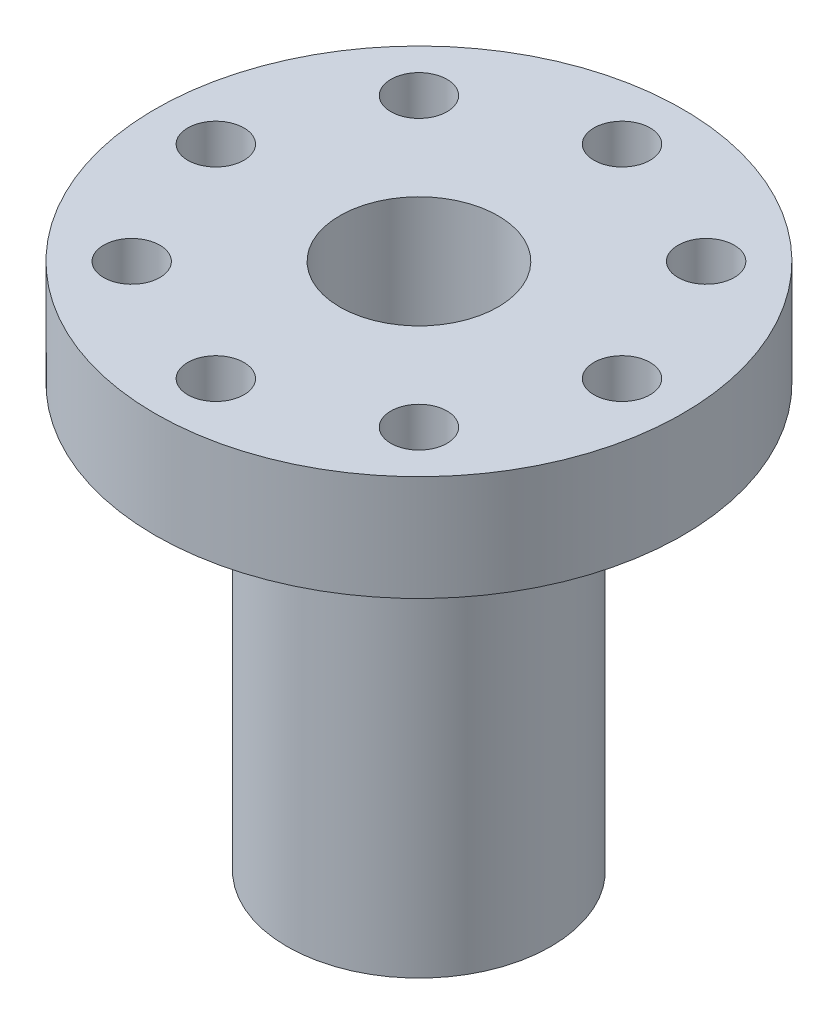
ISO-10303-21;
HEADER;
FILE_DESCRIPTION(('STEP AP214'),'2;1');
FILE_NAME('part.step','',(''),(''),'','','');
FILE_SCHEMA(('AUTOMOTIVE_DESIGN { 1 0 10303 214 1 1 1 1 }'));
ENDSEC;
DATA;
#1=APPLICATION_CONTEXT('core data for automotive mechanical design processes');
#2=APPLICATION_PROTOCOL_DEFINITION('international standard','automotive_design',2000,#1);
#3=PRODUCT_CONTEXT('',#1,'mechanical');
#4=PRODUCT('Part','Part','',(#3));
#5=PRODUCT_RELATED_PRODUCT_CATEGORY('part','',(#4));
#6=PRODUCT_DEFINITION_FORMATION('','',#4);
#7=PRODUCT_DEFINITION_CONTEXT('part definition',#1,'design');
#8=PRODUCT_DEFINITION('design','',#6,#7);
#9=PRODUCT_DEFINITION_SHAPE('','',#8);
#10=(LENGTH_UNIT() NAMED_UNIT(*) SI_UNIT(.MILLI.,.METRE.));
#11=(NAMED_UNIT(*) PLANE_ANGLE_UNIT() SI_UNIT($,.RADIAN.));
#12=(NAMED_UNIT(*) SI_UNIT($,.STERADIAN.) SOLID_ANGLE_UNIT());
#13=UNCERTAINTY_MEASURE_WITH_UNIT(LENGTH_MEASURE(1.E-05),#10,'distance_accuracy_value','');
#14=(GEOMETRIC_REPRESENTATION_CONTEXT(3) GLOBAL_UNCERTAINTY_ASSIGNED_CONTEXT((#13)) GLOBAL_UNIT_ASSIGNED_CONTEXT((#10,
#11,#12)) REPRESENTATION_CONTEXT('',''));
#15=CARTESIAN_POINT('',(0.,0.,0.));
#16=DIRECTION('',(0.,0.,1.));
#17=DIRECTION('',(1.,0.,0.));
#18=AXIS2_PLACEMENT_3D('',#15,#16,#17);
#19=CARTESIAN_POINT('',(0.,0.,0.));
#20=DIRECTION('',(0.,1.,0.));
#21=DIRECTION('',(0.,0.,1.));
#22=AXIS2_PLACEMENT_3D('',#19,#20,#21);
#23=CYLINDRICAL_SURFACE('',#22,12.7);
#24=CARTESIAN_POINT('',(0.,0.,0.));
#25=DIRECTION('',(0.,1.,0.));
#26=DIRECTION('',(0.,0.,1.));
#27=AXIS2_PLACEMENT_3D('',#24,#25,#26);
#28=CIRCLE('',#27,12.7);
#29=CARTESIAN_POINT('',(0.,0.,12.7));
#30=VERTEX_POINT('',#29);
#31=EDGE_CURVE('E10',#30,#30,#28,.T.);
#32=ORIENTED_EDGE('',*,*,#31,.F.);
#33=EDGE_LOOP('',(#32));
#34=FACE_BOUND('',#33,.T.);
#35=CARTESIAN_POINT('',(0.,-5.08,0.));
#36=DIRECTION('',(0.,1.,0.));
#37=DIRECTION('',(0.,0.,1.));
#38=AXIS2_PLACEMENT_3D('',#35,#36,#37);
#39=CIRCLE('',#38,12.7);
#40=CARTESIAN_POINT('',(0.,-5.08,12.7));
#41=VERTEX_POINT('',#40);
#42=EDGE_CURVE('E46',#41,#41,#39,.T.);
#43=ORIENTED_EDGE('',*,*,#42,.T.);
#44=EDGE_LOOP('',(#43));
#45=FACE_BOUND('',#44,.T.);
#46=ADVANCED_FACE('F32',(#34,#45),#23,.T.);
#47=CARTESIAN_POINT('',(12.7,0.,0.));
#48=DIRECTION('',(0.,-1.,0.));
#49=DIRECTION('',(0.,0.,-1.));
#50=AXIS2_PLACEMENT_3D('',#47,#48,#49);
#51=PLANE('',#50);
#52=CARTESIAN_POINT('',(0.,0.,0.));
#53=DIRECTION('',(0.,1.,0.));
#54=DIRECTION('',(0.,0.,1.));
#55=AXIS2_PLACEMENT_3D('',#52,#53,#54);
#56=CIRCLE('',#55,3.81);
#57=CARTESIAN_POINT('',(0.,0.,3.81));
#58=VERTEX_POINT('',#57);
#59=EDGE_CURVE('E100',#58,#58,#56,.T.);
#60=ORIENTED_EDGE('',*,*,#59,.F.);
#61=EDGE_LOOP('',(#60));
#62=FACE_BOUND('',#61,.T.);
#63=CARTESIAN_POINT('',(-6.91479721322316,0.,6.91479721322333));
#64=DIRECTION('',(0.,1.,0.));
#65=DIRECTION('',(0.,0.,1.));
#66=AXIS2_PLACEMENT_3D('',#63,#64,#65);
#67=CIRCLE('',#66,1.35255);
#68=CARTESIAN_POINT('',(-6.91479721322316,0.,8.26734721322333));
#69=VERTEX_POINT('',#68);
#70=EDGE_CURVE('E96',#69,#69,#67,.T.);
#71=ORIENTED_EDGE('',*,*,#70,.F.);
#72=EDGE_LOOP('',(#71));
#73=FACE_BOUND('',#72,.T.);
#74=CARTESIAN_POINT('',(-9.779,0.,1.02429588037641E-13));
#75=DIRECTION('',(0.,1.,0.));
#76=DIRECTION('',(0.,0.,1.));
#77=AXIS2_PLACEMENT_3D('',#74,#75,#76);
#78=CIRCLE('',#77,1.35255);
#79=CARTESIAN_POINT('',(-9.779,0.,1.3525500000001));
#80=VERTEX_POINT('',#79);
#81=EDGE_CURVE('E90',#80,#80,#78,.T.);
#82=ORIENTED_EDGE('',*,*,#81,.F.);
#83=EDGE_LOOP('',(#82));
#84=FACE_BOUND('',#83,.T.);
#85=CARTESIAN_POINT('',(-6.91479721322331,0.,-6.91479721322319));
#86=DIRECTION('',(0.,1.,0.));
#87=DIRECTION('',(0.,0.,1.));
#88=AXIS2_PLACEMENT_3D('',#85,#86,#87);
#89=CIRCLE('',#88,1.35255);
#90=CARTESIAN_POINT('',(-6.91479721322331,0.,-5.56224721322319));
#91=VERTEX_POINT('',#90);
#92=EDGE_CURVE('E84',#91,#91,#89,.T.);
#93=ORIENTED_EDGE('',*,*,#92,.F.);
#94=EDGE_LOOP('',(#93));
#95=FACE_BOUND('',#94,.T.);
#96=CARTESIAN_POINT('',(0.,0.,-9.779));
#97=DIRECTION('',(0.,1.,0.));
#98=DIRECTION('',(0.,0.,1.));
#99=AXIS2_PLACEMENT_3D('',#96,#97,#98);
#100=CIRCLE('',#99,1.35255);
#101=CARTESIAN_POINT('',(0.,0.,-8.42645));
#102=VERTEX_POINT('',#101);
#103=EDGE_CURVE('E78',#102,#102,#100,.T.);
#104=ORIENTED_EDGE('',*,*,#103,.F.);
#105=EDGE_LOOP('',(#104));
#106=FACE_BOUND('',#105,.T.);
#107=CARTESIAN_POINT('',(6.91479721322321,0.,-6.91479721322328));
#108=DIRECTION('',(0.,1.,0.));
#109=DIRECTION('',(0.,0.,1.));
#110=AXIS2_PLACEMENT_3D('',#107,#108,#109);
#111=CIRCLE('',#110,1.35255);
#112=CARTESIAN_POINT('',(6.91479721322321,0.,-5.56224721322329));
#113=VERTEX_POINT('',#112);
#114=EDGE_CURVE('E72',#113,#113,#111,.T.);
#115=ORIENTED_EDGE('',*,*,#114,.F.);
#116=EDGE_LOOP('',(#115));
#117=FACE_BOUND('',#116,.T.);
#118=CARTESIAN_POINT('',(9.779,0.,0.));
#119=DIRECTION('',(0.,1.,0.));
#120=DIRECTION('',(0.,0.,1.));
#121=AXIS2_PLACEMENT_3D('',#118,#119,#120);
#122=CIRCLE('',#121,1.35255);
#123=CARTESIAN_POINT('',(9.779,0.,1.35254999999996));
#124=VERTEX_POINT('',#123);
#125=EDGE_CURVE('E66',#124,#124,#122,.T.);
#126=ORIENTED_EDGE('',*,*,#125,.F.);
#127=EDGE_LOOP('',(#126));
#128=FACE_BOUND('',#127,.T.);
#129=CARTESIAN_POINT('',(6.91479721322326,0.,6.91479721322324));
#130=DIRECTION('',(0.,1.,0.));
#131=DIRECTION('',(0.,0.,1.));
#132=AXIS2_PLACEMENT_3D('',#129,#130,#131);
#133=CIRCLE('',#132,1.35255);
#134=CARTESIAN_POINT('',(6.91479721322326,0.,8.26734721322324));
#135=VERTEX_POINT('',#134);
#136=EDGE_CURVE('E60',#135,#135,#133,.T.);
#137=ORIENTED_EDGE('',*,*,#136,.F.);
#138=EDGE_LOOP('',(#137));
#139=FACE_BOUND('',#138,.T.);
#140=CARTESIAN_POINT('',(0.,0.,9.779));
#141=DIRECTION('',(0.,1.,0.));
#142=DIRECTION('',(0.,0.,1.));
#143=AXIS2_PLACEMENT_3D('',#140,#141,#142);
#144=CIRCLE('',#143,1.35255);
#145=CARTESIAN_POINT('',(0.,0.,11.13155));
#146=VERTEX_POINT('',#145);
#147=EDGE_CURVE('E54',#146,#146,#144,.T.);
#148=ORIENTED_EDGE('',*,*,#147,.F.);
#149=EDGE_LOOP('',(#148));
#150=FACE_BOUND('',#149,.T.);
#151=ORIENTED_EDGE('',*,*,#31,.T.);
#152=EDGE_LOOP('',(#151));
#153=FACE_BOUND('',#152,.T.);
#154=ADVANCED_FACE('F134',(#62,#73,#84,#95,#106,#117,#128,#139,#150,#153),#51,.F.);
#155=CARTESIAN_POINT('',(0.,-25.4,0.));
#156=DIRECTION('',(0.,1.,0.));
#157=DIRECTION('',(0.,0.,1.));
#158=AXIS2_PLACEMENT_3D('',#155,#156,#157);
#159=PLANE('',#158);
#160=CARTESIAN_POINT('',(0.,-25.4,0.));
#161=DIRECTION('',(0.,1.,0.));
#162=DIRECTION('',(0.,0.,1.));
#163=AXIS2_PLACEMENT_3D('',#160,#161,#162);
#164=CIRCLE('',#163,1.4986);
#165=CARTESIAN_POINT('',(0.,-25.4,1.4986));
#166=VERTEX_POINT('',#165);
#167=EDGE_CURVE('E103',#166,#166,#164,.T.);
#168=ORIENTED_EDGE('',*,*,#167,.T.);
#169=EDGE_LOOP('',(#168));
#170=FACE_BOUND('',#169,.T.);
#171=CARTESIAN_POINT('',(0.,-25.4,0.));
#172=DIRECTION('',(0.,1.,0.));
#173=DIRECTION('',(0.,0.,1.));
#174=AXIS2_PLACEMENT_3D('',#171,#172,#173);
#175=CIRCLE('',#174,6.35);
#176=CARTESIAN_POINT('',(0.,-25.4,6.35));
#177=VERTEX_POINT('',#176);
#178=EDGE_CURVE('E38',#177,#177,#175,.T.);
#179=ORIENTED_EDGE('',*,*,#178,.F.);
#180=EDGE_LOOP('',(#179));
#181=FACE_BOUND('',#180,.T.);
#182=ADVANCED_FACE('F112',(#170,#181),#159,.F.);
#183=CARTESIAN_POINT('',(0.,0.,0.));
#184=DIRECTION('',(0.,1.,0.));
#185=DIRECTION('',(0.,0.,1.));
#186=AXIS2_PLACEMENT_3D('',#183,#184,#185);
#187=CYLINDRICAL_SURFACE('',#186,6.35);
#188=CARTESIAN_POINT('',(0.,-5.08,0.));
#189=DIRECTION('',(0.,1.,0.));
#190=DIRECTION('',(0.,0.,1.));
#191=AXIS2_PLACEMENT_3D('',#188,#189,#190);
#192=CIRCLE('',#191,6.35);
#193=CARTESIAN_POINT('',(0.,-5.08,6.35));
#194=VERTEX_POINT('',#193);
#195=EDGE_CURVE('E42',#194,#194,#192,.T.);
#196=ORIENTED_EDGE('',*,*,#195,.F.);
#197=EDGE_LOOP('',(#196));
#198=FACE_BOUND('',#197,.T.);
#199=ORIENTED_EDGE('',*,*,#178,.T.);
#200=EDGE_LOOP('',(#199));
#201=FACE_BOUND('',#200,.T.);
#202=ADVANCED_FACE('F163',(#198,#201),#187,.T.);
#203=CARTESIAN_POINT('',(6.35,-5.08,0.));
#204=DIRECTION('',(0.,1.,0.));
#205=DIRECTION('',(0.,0.,1.));
#206=AXIS2_PLACEMENT_3D('',#203,#204,#205);
#207=PLANE('',#206);
#208=CARTESIAN_POINT('',(-6.91479721322316,-5.08,6.91479721322333));
#209=DIRECTION('',(0.,1.,0.));
#210=DIRECTION('',(0.,0.,1.));
#211=AXIS2_PLACEMENT_3D('',#208,#209,#210);
#212=CIRCLE('',#211,1.35255);
#213=CARTESIAN_POINT('',(-6.91479721322316,-5.08,8.26734721322333));
#214=VERTEX_POINT('',#213);
#215=EDGE_CURVE('E93',#214,#214,#212,.T.);
#216=ORIENTED_EDGE('',*,*,#215,.T.);
#217=EDGE_LOOP('',(#216));
#218=FACE_BOUND('',#217,.T.);
#219=CARTESIAN_POINT('',(-9.779,-5.08,1.02429588037641E-13));
#220=DIRECTION('',(0.,1.,0.));
#221=DIRECTION('',(0.,0.,1.));
#222=AXIS2_PLACEMENT_3D('',#219,#220,#221);
#223=CIRCLE('',#222,1.35255);
#224=CARTESIAN_POINT('',(-9.779,-5.08,1.3525500000001));
#225=VERTEX_POINT('',#224);
#226=EDGE_CURVE('E87',#225,#225,#223,.T.);
#227=ORIENTED_EDGE('',*,*,#226,.T.);
#228=EDGE_LOOP('',(#227));
#229=FACE_BOUND('',#228,.T.);
#230=CARTESIAN_POINT('',(-6.91479721322331,-5.08,-6.91479721322319));
#231=DIRECTION('',(0.,1.,0.));
#232=DIRECTION('',(0.,0.,1.));
#233=AXIS2_PLACEMENT_3D('',#230,#231,#232);
#234=CIRCLE('',#233,1.35255);
#235=CARTESIAN_POINT('',(-6.91479721322331,-5.08,-5.56224721322319));
#236=VERTEX_POINT('',#235);
#237=EDGE_CURVE('E81',#236,#236,#234,.T.);
#238=ORIENTED_EDGE('',*,*,#237,.T.);
#239=EDGE_LOOP('',(#238));
#240=FACE_BOUND('',#239,.T.);
#241=CARTESIAN_POINT('',(0.,-5.08,-9.779));
#242=DIRECTION('',(0.,1.,0.));
#243=DIRECTION('',(0.,0.,1.));
#244=AXIS2_PLACEMENT_3D('',#241,#242,#243);
#245=CIRCLE('',#244,1.35255);
#246=CARTESIAN_POINT('',(0.,-5.08,-8.42645));
#247=VERTEX_POINT('',#246);
#248=EDGE_CURVE('E75',#247,#247,#245,.T.);
#249=ORIENTED_EDGE('',*,*,#248,.T.);
#250=EDGE_LOOP('',(#249));
#251=FACE_BOUND('',#250,.T.);
#252=CARTESIAN_POINT('',(6.91479721322321,-5.08,-6.91479721322328));
#253=DIRECTION('',(0.,1.,0.));
#254=DIRECTION('',(0.,0.,1.));
#255=AXIS2_PLACEMENT_3D('',#252,#253,#254);
#256=CIRCLE('',#255,1.35255);
#257=CARTESIAN_POINT('',(6.91479721322321,-5.08,-5.56224721322329));
#258=VERTEX_POINT('',#257);
#259=EDGE_CURVE('E69',#258,#258,#256,.T.);
#260=ORIENTED_EDGE('',*,*,#259,.T.);
#261=EDGE_LOOP('',(#260));
#262=FACE_BOUND('',#261,.T.);
#263=CARTESIAN_POINT('',(9.779,-5.08,0.));
#264=DIRECTION('',(0.,1.,0.));
#265=DIRECTION('',(0.,0.,1.));
#266=AXIS2_PLACEMENT_3D('',#263,#264,#265);
#267=CIRCLE('',#266,1.35255);
#268=CARTESIAN_POINT('',(9.779,-5.08,1.35254999999996));
#269=VERTEX_POINT('',#268);
#270=EDGE_CURVE('E63',#269,#269,#267,.T.);
#271=ORIENTED_EDGE('',*,*,#270,.T.);
#272=EDGE_LOOP('',(#271));
#273=FACE_BOUND('',#272,.T.);
#274=CARTESIAN_POINT('',(6.91479721322326,-5.08,6.91479721322324));
#275=DIRECTION('',(0.,1.,0.));
#276=DIRECTION('',(0.,0.,1.));
#277=AXIS2_PLACEMENT_3D('',#274,#275,#276);
#278=CIRCLE('',#277,1.35255);
#279=CARTESIAN_POINT('',(6.91479721322326,-5.08,8.26734721322324));
#280=VERTEX_POINT('',#279);
#281=EDGE_CURVE('E57',#280,#280,#278,.T.);
#282=ORIENTED_EDGE('',*,*,#281,.T.);
#283=EDGE_LOOP('',(#282));
#284=FACE_BOUND('',#283,.T.);
#285=CARTESIAN_POINT('',(0.,-5.08,9.779));
#286=DIRECTION('',(0.,1.,0.));
#287=DIRECTION('',(0.,0.,1.));
#288=AXIS2_PLACEMENT_3D('',#285,#286,#287);
#289=CIRCLE('',#288,1.35255);
#290=CARTESIAN_POINT('',(0.,-5.08,11.13155));
#291=VERTEX_POINT('',#290);
#292=EDGE_CURVE('E51',#291,#291,#289,.T.);
#293=ORIENTED_EDGE('',*,*,#292,.T.);
#294=EDGE_LOOP('',(#293));
#295=FACE_BOUND('',#294,.T.);
#296=ORIENTED_EDGE('',*,*,#42,.F.);
#297=EDGE_LOOP('',(#296));
#298=FACE_BOUND('',#297,.T.);
#299=ORIENTED_EDGE('',*,*,#195,.T.);
#300=EDGE_LOOP('',(#299));
#301=FACE_BOUND('',#300,.T.);
#302=ADVANCED_FACE('F157',(#218,#229,#240,#251,#262,#273,#284,#295,#298,#301),#207,.F.);
#303=CARTESIAN_POINT('',(0.,0.,9.779));
#304=DIRECTION('',(0.,1.,0.));
#305=DIRECTION('',(0.,0.,1.));
#306=AXIS2_PLACEMENT_3D('',#303,#304,#305);
#307=CYLINDRICAL_SURFACE('',#306,1.35255);
#308=ORIENTED_EDGE('',*,*,#147,.T.);
#309=EDGE_LOOP('',(#308));
#310=FACE_BOUND('',#309,.T.);
#311=ORIENTED_EDGE('',*,*,#292,.F.);
#312=EDGE_LOOP('',(#311));
#313=FACE_BOUND('',#312,.T.);
#314=ADVANCED_FACE('F153',(#310,#313),#307,.F.);
#315=CARTESIAN_POINT('',(6.91479721322326,0.,6.91479721322324));
#316=DIRECTION('',(0.,1.,0.));
#317=DIRECTION('',(0.,0.,1.));
#318=AXIS2_PLACEMENT_3D('',#315,#316,#317);
#319=CYLINDRICAL_SURFACE('',#318,1.35255);
#320=ORIENTED_EDGE('',*,*,#136,.T.);
#321=EDGE_LOOP('',(#320));
#322=FACE_BOUND('',#321,.T.);
#323=ORIENTED_EDGE('',*,*,#281,.F.);
#324=EDGE_LOOP('',(#323));
#325=FACE_BOUND('',#324,.T.);
#326=ADVANCED_FACE('F156',(#322,#325),#319,.F.);
#327=CARTESIAN_POINT('',(9.779,0.,0.));
#328=DIRECTION('',(0.,1.,0.));
#329=DIRECTION('',(0.,0.,1.));
#330=AXIS2_PLACEMENT_3D('',#327,#328,#329);
#331=CYLINDRICAL_SURFACE('',#330,1.35255);
#332=ORIENTED_EDGE('',*,*,#125,.T.);
#333=EDGE_LOOP('',(#332));
#334=FACE_BOUND('',#333,.T.);
#335=ORIENTED_EDGE('',*,*,#270,.F.);
#336=EDGE_LOOP('',(#335));
#337=FACE_BOUND('',#336,.T.);
#338=ADVANCED_FACE('F248',(#334,#337),#331,.F.);
#339=CARTESIAN_POINT('',(6.91479721322321,0.,-6.91479721322328));
#340=DIRECTION('',(0.,1.,0.));
#341=DIRECTION('',(0.,0.,1.));
#342=AXIS2_PLACEMENT_3D('',#339,#340,#341);
#343=CYLINDRICAL_SURFACE('',#342,1.35255);
#344=ORIENTED_EDGE('',*,*,#114,.T.);
#345=EDGE_LOOP('',(#344));
#346=FACE_BOUND('',#345,.T.);
#347=ORIENTED_EDGE('',*,*,#259,.F.);
#348=EDGE_LOOP('',(#347));
#349=FACE_BOUND('',#348,.T.);
#350=ADVANCED_FACE('F241',(#346,#349),#343,.F.);
#351=CARTESIAN_POINT('',(0.,0.,-9.779));
#352=DIRECTION('',(0.,1.,0.));
#353=DIRECTION('',(0.,0.,1.));
#354=AXIS2_PLACEMENT_3D('',#351,#352,#353);
#355=CYLINDRICAL_SURFACE('',#354,1.35255);
#356=ORIENTED_EDGE('',*,*,#103,.T.);
#357=EDGE_LOOP('',(#356));
#358=FACE_BOUND('',#357,.T.);
#359=ORIENTED_EDGE('',*,*,#248,.F.);
#360=EDGE_LOOP('',(#359));
#361=FACE_BOUND('',#360,.T.);
#362=ADVANCED_FACE('F234',(#358,#361),#355,.F.);
#363=CARTESIAN_POINT('',(-6.91479721322331,0.,-6.91479721322319));
#364=DIRECTION('',(0.,1.,0.));
#365=DIRECTION('',(0.,0.,1.));
#366=AXIS2_PLACEMENT_3D('',#363,#364,#365);
#367=CYLINDRICAL_SURFACE('',#366,1.35255);
#368=ORIENTED_EDGE('',*,*,#92,.T.);
#369=EDGE_LOOP('',(#368));
#370=FACE_BOUND('',#369,.T.);
#371=ORIENTED_EDGE('',*,*,#237,.F.);
#372=EDGE_LOOP('',(#371));
#373=FACE_BOUND('',#372,.T.);
#374=ADVANCED_FACE('F224',(#370,#373),#367,.F.);
#375=CARTESIAN_POINT('',(-9.779,0.,1.02429588037641E-13));
#376=DIRECTION('',(0.,1.,0.));
#377=DIRECTION('',(0.,0.,1.));
#378=AXIS2_PLACEMENT_3D('',#375,#376,#377);
#379=CYLINDRICAL_SURFACE('',#378,1.35255);
#380=ORIENTED_EDGE('',*,*,#81,.T.);
#381=EDGE_LOOP('',(#380));
#382=FACE_BOUND('',#381,.T.);
#383=ORIENTED_EDGE('',*,*,#226,.F.);
#384=EDGE_LOOP('',(#383));
#385=FACE_BOUND('',#384,.T.);
#386=ADVANCED_FACE('F215',(#382,#385),#379,.F.);
#387=CARTESIAN_POINT('',(-6.91479721322316,0.,6.91479721322333));
#388=DIRECTION('',(0.,1.,0.));
#389=DIRECTION('',(0.,0.,1.));
#390=AXIS2_PLACEMENT_3D('',#387,#388,#389);
#391=CYLINDRICAL_SURFACE('',#390,1.35255);
#392=ORIENTED_EDGE('',*,*,#70,.T.);
#393=EDGE_LOOP('',(#392));
#394=FACE_BOUND('',#393,.T.);
#395=ORIENTED_EDGE('',*,*,#215,.F.);
#396=EDGE_LOOP('',(#395));
#397=FACE_BOUND('',#396,.T.);
#398=ADVANCED_FACE('F130',(#394,#397),#391,.F.);
#399=CARTESIAN_POINT('',(0.,-20.828,0.));
#400=DIRECTION('',(0.,1.,0.));
#401=DIRECTION('',(0.,0.,1.));
#402=AXIS2_PLACEMENT_3D('',#399,#400,#401);
#403=CYLINDRICAL_SURFACE('',#402,3.81);
#404=CARTESIAN_POINT('',(0.,-20.828,0.));
#405=DIRECTION('',(0.,1.,0.));
#406=DIRECTION('',(0.,0.,1.));
#407=AXIS2_PLACEMENT_3D('',#404,#405,#406);
#408=CIRCLE('',#407,3.81);
#409=CARTESIAN_POINT('',(0.,-20.828,3.81));
#410=VERTEX_POINT('',#409);
#411=EDGE_CURVE('E99',#410,#410,#408,.T.);
#412=ORIENTED_EDGE('',*,*,#411,.F.);
#413=EDGE_LOOP('',(#412));
#414=FACE_BOUND('',#413,.T.);
#415=ORIENTED_EDGE('',*,*,#59,.T.);
#416=EDGE_LOOP('',(#415));
#417=FACE_BOUND('',#416,.T.);
#418=ADVANCED_FACE('F124',(#414,#417),#403,.F.);
#419=CARTESIAN_POINT('',(0.,-20.828,0.));
#420=DIRECTION('',(0.,1.,0.));
#421=DIRECTION('',(0.,0.,1.));
#422=AXIS2_PLACEMENT_3D('',#419,#420,#421);
#423=PLANE('',#422);
#424=CARTESIAN_POINT('',(0.,-20.828,0.));
#425=DIRECTION('',(0.,1.,0.));
#426=DIRECTION('',(0.,0.,1.));
#427=AXIS2_PLACEMENT_3D('',#424,#425,#426);
#428=CIRCLE('',#427,1.4986);
#429=CARTESIAN_POINT('',(0.,-20.828,1.4986));
#430=VERTEX_POINT('',#429);
#431=EDGE_CURVE('E106',#430,#430,#428,.T.);
#432=ORIENTED_EDGE('',*,*,#431,.F.);
#433=EDGE_LOOP('',(#432));
#434=FACE_BOUND('',#433,.T.);
#435=ORIENTED_EDGE('',*,*,#411,.T.);
#436=EDGE_LOOP('',(#435));
#437=FACE_BOUND('',#436,.T.);
#438=ADVANCED_FACE('F118',(#434,#437),#423,.T.);
#439=CARTESIAN_POINT('',(0.,-25.4,0.));
#440=DIRECTION('',(0.,1.,0.));
#441=DIRECTION('',(0.,0.,1.));
#442=AXIS2_PLACEMENT_3D('',#439,#440,#441);
#443=CYLINDRICAL_SURFACE('',#442,1.4986);
#444=ORIENTED_EDGE('',*,*,#167,.F.);
#445=EDGE_LOOP('',(#444));
#446=FACE_BOUND('',#445,.T.);
#447=ORIENTED_EDGE('',*,*,#431,.T.);
#448=EDGE_LOOP('',(#447));
#449=FACE_BOUND('',#448,.T.);
#450=ADVANCED_FACE('F115',(#446,#449),#443,.F.);
#451=CLOSED_SHELL('',(#46,#154,#182,#202,#302,#314,#326,#338,#350,#362,#374,#386,#398,#418,#438,#450));
#452=MANIFOLD_SOLID_BREP('B2',#451);
#453=ADVANCED_BREP_SHAPE_REPRESENTATION('',(#18,#452),#14);
#454=SHAPE_DEFINITION_REPRESENTATION(#9,#453);
ENDSEC;
END-ISO-10303-21;
